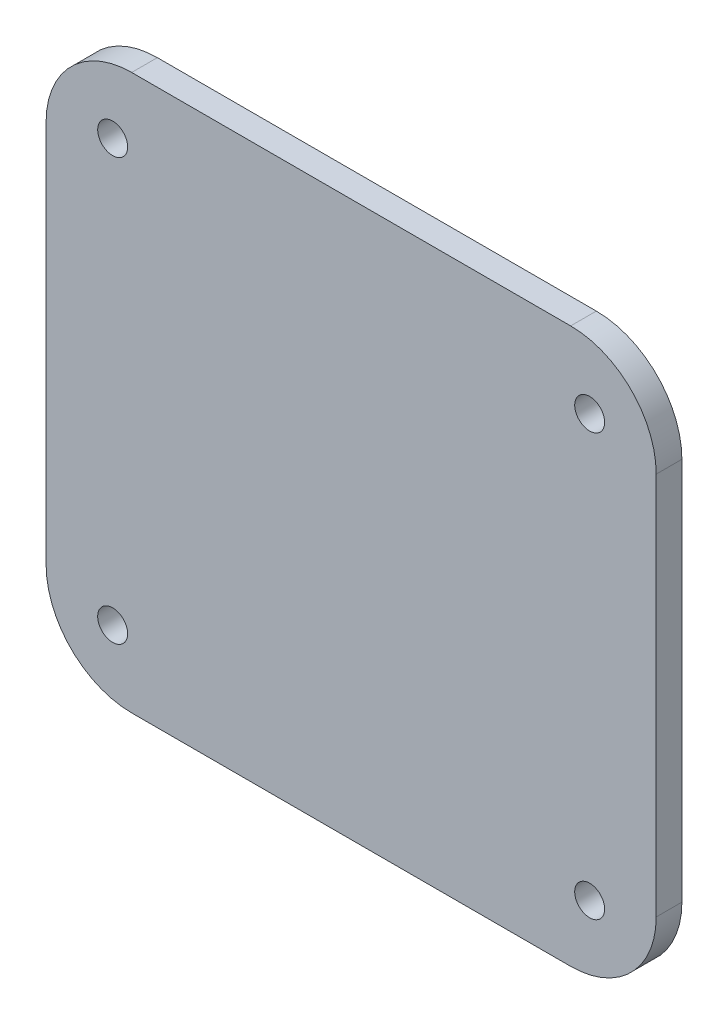
ISO-10303-21;
HEADER;
FILE_DESCRIPTION(('STEP AP214'),'2;1');
FILE_NAME('part.step','',(''),(''),'','','');
FILE_SCHEMA(('AUTOMOTIVE_DESIGN { 1 0 10303 214 1 1 1 1 }'));
ENDSEC;
DATA;
#1=APPLICATION_CONTEXT('core data for automotive mechanical design processes');
#2=APPLICATION_PROTOCOL_DEFINITION('international standard','automotive_design',2000,#1);
#3=PRODUCT_CONTEXT('',#1,'mechanical');
#4=PRODUCT('Part','Part','',(#3));
#5=PRODUCT_RELATED_PRODUCT_CATEGORY('part','',(#4));
#6=PRODUCT_DEFINITION_FORMATION('','',#4);
#7=PRODUCT_DEFINITION_CONTEXT('part definition',#1,'design');
#8=PRODUCT_DEFINITION('design','',#6,#7);
#9=PRODUCT_DEFINITION_SHAPE('','',#8);
#10=(LENGTH_UNIT() NAMED_UNIT(*) SI_UNIT(.MILLI.,.METRE.));
#11=(NAMED_UNIT(*) PLANE_ANGLE_UNIT() SI_UNIT($,.RADIAN.));
#12=(NAMED_UNIT(*) SI_UNIT($,.STERADIAN.) SOLID_ANGLE_UNIT());
#13=UNCERTAINTY_MEASURE_WITH_UNIT(LENGTH_MEASURE(1.E-05),#10,'distance_accuracy_value','');
#14=(GEOMETRIC_REPRESENTATION_CONTEXT(3) GLOBAL_UNCERTAINTY_ASSIGNED_CONTEXT((#13)) GLOBAL_UNIT_ASSIGNED_CONTEXT((#10,
#11,#12)) REPRESENTATION_CONTEXT('',''));
#15=CARTESIAN_POINT('',(0.,0.,0.));
#16=DIRECTION('',(0.,0.,1.));
#17=DIRECTION('',(1.,0.,0.));
#18=AXIS2_PLACEMENT_3D('',#15,#16,#17);
#19=CARTESIAN_POINT('',(0.,32.4252959785369,3.));
#20=DIRECTION('',(0.,-1.,0.));
#21=DIRECTION('',(0.,0.,-1.));
#22=AXIS2_PLACEMENT_3D('',#19,#20,#21);
#23=PLANE('',#22);
#24=DIRECTION('',(-1.,0.,0.));
#25=VECTOR('',#24,1.);
#26=CARTESIAN_POINT('',(0.,32.4252959785369,3.));
#27=LINE('',#26,#25);
#28=CARTESIAN_POINT('',(25.9780640714253,32.4252959785369,3.));
#29=VERTEX_POINT('',#28);
#30=CARTESIAN_POINT('',(-25.318232224871,32.4252959785369,3.));
#31=VERTEX_POINT('',#30);
#32=EDGE_CURVE('E185',#29,#31,#27,.T.);
#33=ORIENTED_EDGE('',*,*,#32,.F.);
#34=DIRECTION('',(0.,0.,-1.));
#35=VECTOR('',#34,1.);
#36=CARTESIAN_POINT('',(25.9780640714253,32.4252959785369,3.));
#37=LINE('',#36,#35);
#38=CARTESIAN_POINT('',(25.9780640714253,32.4252959785369,0.));
#39=VERTEX_POINT('',#38);
#40=EDGE_CURVE('E11',#29,#39,#37,.T.);
#41=ORIENTED_EDGE('',*,*,#40,.T.);
#42=DIRECTION('',(-1.,0.,0.));
#43=VECTOR('',#42,1.);
#44=CARTESIAN_POINT('',(0.,32.4252959785369,0.));
#45=LINE('',#44,#43);
#46=CARTESIAN_POINT('',(-25.318232224871,32.4252959785369,0.));
#47=VERTEX_POINT('',#46);
#48=EDGE_CURVE('E144',#39,#47,#45,.T.);
#49=ORIENTED_EDGE('',*,*,#48,.T.);
#50=DIRECTION('',(0.,0.,-1.));
#51=VECTOR('',#50,1.);
#52=CARTESIAN_POINT('',(-25.318232224871,32.4252959785369,3.));
#53=LINE('',#52,#51);
#54=EDGE_CURVE('E50',#47,#31,#53,.F.);
#55=ORIENTED_EDGE('',*,*,#54,.T.);
#56=EDGE_LOOP('',(#33,#41,#49,#55));
#57=FACE_BOUND('',#56,.T.);
#58=ADVANCED_FACE('F41',(#57),#23,.F.);
#59=CARTESIAN_POINT('',(-35.318232224871,0.,3.));
#60=DIRECTION('',(1.,0.,0.));
#61=DIRECTION('',(0.,0.,-1.));
#62=AXIS2_PLACEMENT_3D('',#59,#60,#61);
#63=PLANE('',#62);
#64=DIRECTION('',(0.,-1.,0.));
#65=VECTOR('',#64,1.);
#66=CARTESIAN_POINT('',(-35.318232224871,0.,0.));
#67=LINE('',#66,#65);
#68=CARTESIAN_POINT('',(-35.318232224871,22.4252959785369,0.));
#69=VERTEX_POINT('',#68);
#70=CARTESIAN_POINT('',(-35.318232224871,-22.389518836278,0.));
#71=VERTEX_POINT('',#70);
#72=EDGE_CURVE('E138',#69,#71,#67,.T.);
#73=ORIENTED_EDGE('',*,*,#72,.T.);
#74=DIRECTION('',(0.,0.,-1.));
#75=VECTOR('',#74,1.);
#76=CARTESIAN_POINT('',(-35.318232224871,-22.389518836278,3.));
#77=LINE('',#76,#75);
#78=CARTESIAN_POINT('',(-35.318232224871,-22.389518836278,3.));
#79=VERTEX_POINT('',#78);
#80=EDGE_CURVE('E114',#71,#79,#77,.F.);
#81=ORIENTED_EDGE('',*,*,#80,.T.);
#82=DIRECTION('',(0.,-1.,0.));
#83=VECTOR('',#82,1.);
#84=CARTESIAN_POINT('',(-35.318232224871,0.,3.));
#85=LINE('',#84,#83);
#86=CARTESIAN_POINT('',(-35.318232224871,22.4252959785369,3.));
#87=VERTEX_POINT('',#86);
#88=EDGE_CURVE('E195',#87,#79,#85,.T.);
#89=ORIENTED_EDGE('',*,*,#88,.F.);
#90=DIRECTION('',(0.,0.,-1.));
#91=VECTOR('',#90,1.);
#92=CARTESIAN_POINT('',(-35.318232224871,22.4252959785369,3.));
#93=LINE('',#92,#91);
#94=EDGE_CURVE('E120',#87,#69,#93,.T.);
#95=ORIENTED_EDGE('',*,*,#94,.T.);
#96=EDGE_LOOP('',(#73,#81,#89,#95));
#97=FACE_BOUND('',#96,.T.);
#98=ADVANCED_FACE('F200',(#97),#63,.F.);
#99=CARTESIAN_POINT('',(0.,-32.389518836278,3.));
#100=DIRECTION('',(0.,1.,0.));
#101=DIRECTION('',(0.,0.,1.));
#102=AXIS2_PLACEMENT_3D('',#99,#100,#101);
#103=PLANE('',#102);
#104=DIRECTION('',(1.,0.,0.));
#105=VECTOR('',#104,1.);
#106=CARTESIAN_POINT('',(0.,-32.389518836278,3.));
#107=LINE('',#106,#105);
#108=CARTESIAN_POINT('',(-25.318232224871,-32.389518836278,3.));
#109=VERTEX_POINT('',#108);
#110=CARTESIAN_POINT('',(25.9780640714253,-32.389518836278,3.));
#111=VERTEX_POINT('',#110);
#112=EDGE_CURVE('E129',#109,#111,#107,.T.);
#113=ORIENTED_EDGE('',*,*,#112,.F.);
#114=DIRECTION('',(0.,0.,-1.));
#115=VECTOR('',#114,1.);
#116=CARTESIAN_POINT('',(-25.318232224871,-32.389518836278,3.));
#117=LINE('',#116,#115);
#118=CARTESIAN_POINT('',(-25.318232224871,-32.389518836278,0.));
#119=VERTEX_POINT('',#118);
#120=EDGE_CURVE('E113',#109,#119,#117,.T.);
#121=ORIENTED_EDGE('',*,*,#120,.T.);
#122=DIRECTION('',(1.,0.,0.));
#123=VECTOR('',#122,1.);
#124=CARTESIAN_POINT('',(0.,-32.389518836278,0.));
#125=LINE('',#124,#123);
#126=CARTESIAN_POINT('',(25.9780640714253,-32.389518836278,0.));
#127=VERTEX_POINT('',#126);
#128=EDGE_CURVE('E127',#119,#127,#125,.T.);
#129=ORIENTED_EDGE('',*,*,#128,.T.);
#130=DIRECTION('',(0.,0.,-1.));
#131=VECTOR('',#130,1.);
#132=CARTESIAN_POINT('',(25.9780640714253,-32.389518836278,3.));
#133=LINE('',#132,#131);
#134=EDGE_CURVE('E132',#127,#111,#133,.F.);
#135=ORIENTED_EDGE('',*,*,#134,.T.);
#136=EDGE_LOOP('',(#113,#121,#129,#135));
#137=FACE_BOUND('',#136,.T.);
#138=ADVANCED_FACE('F126',(#137),#103,.F.);
#139=CARTESIAN_POINT('',(-27.5404544470933,24.6475182007591,3.));
#140=DIRECTION('',(0.,0.,-1.));
#141=DIRECTION('',(-1.,0.,0.));
#142=AXIS2_PLACEMENT_3D('',#139,#140,#141);
#143=CYLINDRICAL_SURFACE('',#142,1.75);
#144=CARTESIAN_POINT('',(-27.5404544470933,24.6475182007591,3.));
#145=DIRECTION('',(0.,0.,1.));
#146=DIRECTION('',(1.,0.,0.));
#147=AXIS2_PLACEMENT_3D('',#144,#145,#146);
#148=CIRCLE('',#147,1.75);
#149=CARTESIAN_POINT('',(-25.7904544470933,24.6475182007591,3.));
#150=VERTEX_POINT('',#149);
#151=EDGE_CURVE('E196',#150,#150,#148,.T.);
#152=ORIENTED_EDGE('',*,*,#151,.T.);
#153=EDGE_LOOP('',(#152));
#154=FACE_BOUND('',#153,.T.);
#155=CARTESIAN_POINT('',(-27.5404544470933,24.6475182007591,0.));
#156=DIRECTION('',(0.,0.,1.));
#157=DIRECTION('',(1.,0.,0.));
#158=AXIS2_PLACEMENT_3D('',#155,#156,#157);
#159=CIRCLE('',#158,1.75);
#160=CARTESIAN_POINT('',(-25.7904544470933,24.6475182007591,0.));
#161=VERTEX_POINT('',#160);
#162=EDGE_CURVE('E202',#161,#161,#159,.T.);
#163=ORIENTED_EDGE('',*,*,#162,.F.);
#164=EDGE_LOOP('',(#163));
#165=FACE_BOUND('',#164,.T.);
#166=ADVANCED_FACE('F253',(#154,#165),#143,.F.);
#167=CARTESIAN_POINT('',(28.2002862936475,24.6475182007591,3.));
#168=DIRECTION('',(0.,0.,-1.));
#169=DIRECTION('',(-1.,0.,0.));
#170=AXIS2_PLACEMENT_3D('',#167,#168,#169);
#171=CYLINDRICAL_SURFACE('',#170,1.75);
#172=CARTESIAN_POINT('',(28.2002862936475,24.6475182007591,3.));
#173=DIRECTION('',(0.,0.,1.));
#174=DIRECTION('',(1.,0.,0.));
#175=AXIS2_PLACEMENT_3D('',#172,#173,#174);
#176=CIRCLE('',#175,1.75);
#177=CARTESIAN_POINT('',(29.9502862936475,24.6475182007591,3.));
#178=VERTEX_POINT('',#177);
#179=EDGE_CURVE('E228',#178,#178,#176,.T.);
#180=ORIENTED_EDGE('',*,*,#179,.T.);
#181=EDGE_LOOP('',(#180));
#182=FACE_BOUND('',#181,.T.);
#183=CARTESIAN_POINT('',(28.2002862936475,24.6475182007591,0.));
#184=DIRECTION('',(0.,0.,1.));
#185=DIRECTION('',(1.,0.,0.));
#186=AXIS2_PLACEMENT_3D('',#183,#184,#185);
#187=CIRCLE('',#186,1.75);
#188=CARTESIAN_POINT('',(29.9502862936475,24.6475182007591,0.));
#189=VERTEX_POINT('',#188);
#190=EDGE_CURVE('E205',#189,#189,#187,.T.);
#191=ORIENTED_EDGE('',*,*,#190,.F.);
#192=EDGE_LOOP('',(#191));
#193=FACE_BOUND('',#192,.T.);
#194=ADVANCED_FACE('F256',(#182,#193),#171,.F.);
#195=CARTESIAN_POINT('',(28.200286293648,-24.6117410585002,3.));
#196=DIRECTION('',(0.,0.,-1.));
#197=DIRECTION('',(-1.,0.,0.));
#198=AXIS2_PLACEMENT_3D('',#195,#196,#197);
#199=CYLINDRICAL_SURFACE('',#198,1.75);
#200=CARTESIAN_POINT('',(28.200286293648,-24.6117410585002,3.));
#201=DIRECTION('',(0.,0.,1.));
#202=DIRECTION('',(1.,0.,0.));
#203=AXIS2_PLACEMENT_3D('',#200,#201,#202);
#204=CIRCLE('',#203,1.75);
#205=CARTESIAN_POINT('',(29.950286293648,-24.6117410585002,3.));
#206=VERTEX_POINT('',#205);
#207=EDGE_CURVE('E232',#206,#206,#204,.T.);
#208=ORIENTED_EDGE('',*,*,#207,.T.);
#209=EDGE_LOOP('',(#208));
#210=FACE_BOUND('',#209,.T.);
#211=CARTESIAN_POINT('',(28.200286293648,-24.6117410585002,0.));
#212=DIRECTION('',(0.,0.,1.));
#213=DIRECTION('',(1.,0.,0.));
#214=AXIS2_PLACEMENT_3D('',#211,#212,#213);
#215=CIRCLE('',#214,1.75);
#216=CARTESIAN_POINT('',(29.950286293648,-24.6117410585002,0.));
#217=VERTEX_POINT('',#216);
#218=EDGE_CURVE('E211',#217,#217,#215,.T.);
#219=ORIENTED_EDGE('',*,*,#218,.F.);
#220=EDGE_LOOP('',(#219));
#221=FACE_BOUND('',#220,.T.);
#222=ADVANCED_FACE('F280',(#210,#221),#199,.F.);
#223=CARTESIAN_POINT('',(-27.5404544470927,-24.6117410585002,3.));
#224=DIRECTION('',(0.,0.,-1.));
#225=DIRECTION('',(-1.,0.,0.));
#226=AXIS2_PLACEMENT_3D('',#223,#224,#225);
#227=CYLINDRICAL_SURFACE('',#226,1.75);
#228=CARTESIAN_POINT('',(-27.5404544470927,-24.6117410585002,3.));
#229=DIRECTION('',(0.,0.,1.));
#230=DIRECTION('',(1.,0.,0.));
#231=AXIS2_PLACEMENT_3D('',#228,#229,#230);
#232=CIRCLE('',#231,1.75);
#233=CARTESIAN_POINT('',(-25.7904544470927,-24.6117410585002,3.));
#234=VERTEX_POINT('',#233);
#235=EDGE_CURVE('E142',#234,#234,#232,.T.);
#236=ORIENTED_EDGE('',*,*,#235,.T.);
#237=EDGE_LOOP('',(#236));
#238=FACE_BOUND('',#237,.T.);
#239=CARTESIAN_POINT('',(-27.5404544470927,-24.6117410585002,0.));
#240=DIRECTION('',(0.,0.,1.));
#241=DIRECTION('',(1.,0.,0.));
#242=AXIS2_PLACEMENT_3D('',#239,#240,#241);
#243=CIRCLE('',#242,1.75);
#244=CARTESIAN_POINT('',(-25.7904544470927,-24.6117410585002,0.));
#245=VERTEX_POINT('',#244);
#246=EDGE_CURVE('E215',#245,#245,#243,.T.);
#247=ORIENTED_EDGE('',*,*,#246,.F.);
#248=EDGE_LOOP('',(#247));
#249=FACE_BOUND('',#248,.T.);
#250=ADVANCED_FACE('F240',(#238,#249),#227,.F.);
#251=CARTESIAN_POINT('',(35.9780640714253,0.,3.));
#252=DIRECTION('',(-1.,0.,0.));
#253=DIRECTION('',(0.,0.,1.));
#254=AXIS2_PLACEMENT_3D('',#251,#252,#253);
#255=PLANE('',#254);
#256=DIRECTION('',(0.,1.,0.));
#257=VECTOR('',#256,1.);
#258=CARTESIAN_POINT('',(35.9780640714253,0.,3.));
#259=LINE('',#258,#257);
#260=CARTESIAN_POINT('',(35.9780640714253,-22.389518836278,3.));
#261=VERTEX_POINT('',#260);
#262=CARTESIAN_POINT('',(35.9780640714253,22.4252959785369,3.));
#263=VERTEX_POINT('',#262);
#264=EDGE_CURVE('E149',#261,#263,#259,.T.);
#265=ORIENTED_EDGE('',*,*,#264,.F.);
#266=DIRECTION('',(0.,0.,-1.));
#267=VECTOR('',#266,1.);
#268=CARTESIAN_POINT('',(35.9780640714253,-22.389518836278,3.));
#269=LINE('',#268,#267);
#270=CARTESIAN_POINT('',(35.9780640714253,-22.389518836278,0.));
#271=VERTEX_POINT('',#270);
#272=EDGE_CURVE('E176',#261,#271,#269,.T.);
#273=ORIENTED_EDGE('',*,*,#272,.T.);
#274=DIRECTION('',(0.,1.,0.));
#275=VECTOR('',#274,1.);
#276=CARTESIAN_POINT('',(35.9780640714253,0.,0.));
#277=LINE('',#276,#275);
#278=CARTESIAN_POINT('',(35.9780640714253,22.4252959785369,0.));
#279=VERTEX_POINT('',#278);
#280=EDGE_CURVE('E137',#271,#279,#277,.T.);
#281=ORIENTED_EDGE('',*,*,#280,.T.);
#282=DIRECTION('',(0.,0.,-1.));
#283=VECTOR('',#282,1.);
#284=CARTESIAN_POINT('',(35.9780640714253,22.4252959785369,3.));
#285=LINE('',#284,#283);
#286=EDGE_CURVE('E57',#279,#263,#285,.F.);
#287=ORIENTED_EDGE('',*,*,#286,.T.);
#288=EDGE_LOOP('',(#265,#273,#281,#287));
#289=FACE_BOUND('',#288,.T.);
#290=ADVANCED_FACE('F245',(#289),#255,.F.);
#291=CARTESIAN_POINT('',(0.,0.,3.));
#292=DIRECTION('',(0.,0.,1.));
#293=DIRECTION('',(1.,0.,0.));
#294=AXIS2_PLACEMENT_3D('',#291,#292,#293);
#295=PLANE('',#294);
#296=ORIENTED_EDGE('',*,*,#235,.F.);
#297=EDGE_LOOP('',(#296));
#298=FACE_BOUND('',#297,.T.);
#299=ORIENTED_EDGE('',*,*,#207,.F.);
#300=EDGE_LOOP('',(#299));
#301=FACE_BOUND('',#300,.T.);
#302=ORIENTED_EDGE('',*,*,#179,.F.);
#303=EDGE_LOOP('',(#302));
#304=FACE_BOUND('',#303,.T.);
#305=ORIENTED_EDGE('',*,*,#151,.F.);
#306=EDGE_LOOP('',(#305));
#307=FACE_BOUND('',#306,.T.);
#308=ORIENTED_EDGE('',*,*,#88,.T.);
#309=CARTESIAN_POINT('',(-25.318232224871,-22.389518836278,3.));
#310=DIRECTION('',(0.,0.,1.));
#311=DIRECTION('',(1.,0.,0.));
#312=AXIS2_PLACEMENT_3D('',#309,#310,#311);
#313=CIRCLE('',#312,10.);
#314=EDGE_CURVE('E171',#79,#109,#313,.T.);
#315=ORIENTED_EDGE('',*,*,#314,.T.);
#316=ORIENTED_EDGE('',*,*,#112,.T.);
#317=CARTESIAN_POINT('',(25.9780640714253,-22.389518836278,3.));
#318=DIRECTION('',(0.,0.,1.));
#319=DIRECTION('',(1.,0.,0.));
#320=AXIS2_PLACEMENT_3D('',#317,#318,#319);
#321=CIRCLE('',#320,10.);
#322=EDGE_CURVE('E64',#111,#261,#321,.T.);
#323=ORIENTED_EDGE('',*,*,#322,.T.);
#324=ORIENTED_EDGE('',*,*,#264,.T.);
#325=CARTESIAN_POINT('',(25.9780640714253,22.4252959785369,3.));
#326=DIRECTION('',(0.,0.,1.));
#327=DIRECTION('',(1.,0.,0.));
#328=AXIS2_PLACEMENT_3D('',#325,#326,#327);
#329=CIRCLE('',#328,10.);
#330=EDGE_CURVE('E166',#263,#29,#329,.T.);
#331=ORIENTED_EDGE('',*,*,#330,.T.);
#332=ORIENTED_EDGE('',*,*,#32,.T.);
#333=CARTESIAN_POINT('',(-25.318232224871,22.4252959785369,3.));
#334=DIRECTION('',(0.,0.,1.));
#335=DIRECTION('',(1.,0.,0.));
#336=AXIS2_PLACEMENT_3D('',#333,#334,#335);
#337=CIRCLE('',#336,10.);
#338=EDGE_CURVE('E163',#31,#87,#337,.T.);
#339=ORIENTED_EDGE('',*,*,#338,.T.);
#340=EDGE_LOOP('',(#308,#315,#316,#323,#324,#331,#332,#339));
#341=FACE_BOUND('',#340,.T.);
#342=ADVANCED_FACE('F191',(#298,#301,#304,#307,#341),#295,.T.);
#343=CARTESIAN_POINT('',(0.,0.,0.));
#344=DIRECTION('',(0.,0.,1.));
#345=DIRECTION('',(1.,0.,0.));
#346=AXIS2_PLACEMENT_3D('',#343,#344,#345);
#347=PLANE('',#346);
#348=ORIENTED_EDGE('',*,*,#246,.T.);
#349=EDGE_LOOP('',(#348));
#350=FACE_BOUND('',#349,.T.);
#351=ORIENTED_EDGE('',*,*,#218,.T.);
#352=EDGE_LOOP('',(#351));
#353=FACE_BOUND('',#352,.T.);
#354=ORIENTED_EDGE('',*,*,#190,.T.);
#355=EDGE_LOOP('',(#354));
#356=FACE_BOUND('',#355,.T.);
#357=ORIENTED_EDGE('',*,*,#162,.T.);
#358=EDGE_LOOP('',(#357));
#359=FACE_BOUND('',#358,.T.);
#360=ORIENTED_EDGE('',*,*,#128,.F.);
#361=CARTESIAN_POINT('',(-25.318232224871,-22.389518836278,0.));
#362=DIRECTION('',(0.,0.,1.));
#363=DIRECTION('',(1.,0.,0.));
#364=AXIS2_PLACEMENT_3D('',#361,#362,#363);
#365=CIRCLE('',#364,10.);
#366=EDGE_CURVE('E109',#119,#71,#365,.F.);
#367=ORIENTED_EDGE('',*,*,#366,.T.);
#368=ORIENTED_EDGE('',*,*,#72,.F.);
#369=CARTESIAN_POINT('',(-25.318232224871,22.4252959785369,0.));
#370=DIRECTION('',(0.,0.,1.));
#371=DIRECTION('',(1.,0.,0.));
#372=AXIS2_PLACEMENT_3D('',#369,#370,#371);
#373=CIRCLE('',#372,10.);
#374=EDGE_CURVE('E131',#69,#47,#373,.F.);
#375=ORIENTED_EDGE('',*,*,#374,.T.);
#376=ORIENTED_EDGE('',*,*,#48,.F.);
#377=CARTESIAN_POINT('',(25.9780640714253,22.4252959785369,0.));
#378=DIRECTION('',(0.,0.,1.));
#379=DIRECTION('',(1.,0.,0.));
#380=AXIS2_PLACEMENT_3D('',#377,#378,#379);
#381=CIRCLE('',#380,10.);
#382=EDGE_CURVE('E153',#39,#279,#381,.F.);
#383=ORIENTED_EDGE('',*,*,#382,.T.);
#384=ORIENTED_EDGE('',*,*,#280,.F.);
#385=CARTESIAN_POINT('',(25.9780640714253,-22.389518836278,0.));
#386=DIRECTION('',(0.,0.,1.));
#387=DIRECTION('',(1.,0.,0.));
#388=AXIS2_PLACEMENT_3D('',#385,#386,#387);
#389=CIRCLE('',#388,10.);
#390=EDGE_CURVE('E121',#271,#127,#389,.F.);
#391=ORIENTED_EDGE('',*,*,#390,.T.);
#392=EDGE_LOOP('',(#360,#367,#368,#375,#376,#383,#384,#391));
#393=FACE_BOUND('',#392,.T.);
#394=ADVANCED_FACE('F134',(#350,#353,#356,#359,#393),#347,.F.);
#395=CARTESIAN_POINT('',(-25.318232224871,-22.389518836278,3.));
#396=DIRECTION('',(0.,0.,-1.));
#397=DIRECTION('',(-1.,0.,0.));
#398=AXIS2_PLACEMENT_3D('',#395,#396,#397);
#399=CYLINDRICAL_SURFACE('',#398,10.);
#400=ORIENTED_EDGE('',*,*,#314,.F.);
#401=ORIENTED_EDGE('',*,*,#80,.F.);
#402=ORIENTED_EDGE('',*,*,#366,.F.);
#403=ORIENTED_EDGE('',*,*,#120,.F.);
#404=EDGE_LOOP('',(#400,#401,#402,#403));
#405=FACE_BOUND('',#404,.T.);
#406=ADVANCED_FACE('F112',(#405),#399,.T.);
#407=CARTESIAN_POINT('',(25.9780640714253,-22.389518836278,3.));
#408=DIRECTION('',(0.,0.,-1.));
#409=DIRECTION('',(-1.,0.,0.));
#410=AXIS2_PLACEMENT_3D('',#407,#408,#409);
#411=CYLINDRICAL_SURFACE('',#410,10.);
#412=ORIENTED_EDGE('',*,*,#322,.F.);
#413=ORIENTED_EDGE('',*,*,#134,.F.);
#414=ORIENTED_EDGE('',*,*,#390,.F.);
#415=ORIENTED_EDGE('',*,*,#272,.F.);
#416=EDGE_LOOP('',(#412,#413,#414,#415));
#417=FACE_BOUND('',#416,.T.);
#418=ADVANCED_FACE('F266',(#417),#411,.T.);
#419=CARTESIAN_POINT('',(25.9780640714253,22.4252959785369,3.));
#420=DIRECTION('',(0.,0.,-1.));
#421=DIRECTION('',(-1.,0.,0.));
#422=AXIS2_PLACEMENT_3D('',#419,#420,#421);
#423=CYLINDRICAL_SURFACE('',#422,10.);
#424=ORIENTED_EDGE('',*,*,#330,.F.);
#425=ORIENTED_EDGE('',*,*,#286,.F.);
#426=ORIENTED_EDGE('',*,*,#382,.F.);
#427=ORIENTED_EDGE('',*,*,#40,.F.);
#428=EDGE_LOOP('',(#424,#425,#426,#427));
#429=FACE_BOUND('',#428,.T.);
#430=ADVANCED_FACE('F288',(#429),#423,.T.);
#431=CARTESIAN_POINT('',(-25.318232224871,22.4252959785369,3.));
#432=DIRECTION('',(0.,0.,-1.));
#433=DIRECTION('',(-1.,0.,0.));
#434=AXIS2_PLACEMENT_3D('',#431,#432,#433);
#435=CYLINDRICAL_SURFACE('',#434,10.);
#436=ORIENTED_EDGE('',*,*,#338,.F.);
#437=ORIENTED_EDGE('',*,*,#54,.F.);
#438=ORIENTED_EDGE('',*,*,#374,.F.);
#439=ORIENTED_EDGE('',*,*,#94,.F.);
#440=EDGE_LOOP('',(#436,#437,#438,#439));
#441=FACE_BOUND('',#440,.T.);
#442=ADVANCED_FACE('F43',(#441),#435,.T.);
#443=CLOSED_SHELL('',(#58,#98,#138,#166,#194,#222,#250,#290,#342,#394,#406,#418,#430,#442));
#444=MANIFOLD_SOLID_BREP('B2',#443);
#445=ADVANCED_BREP_SHAPE_REPRESENTATION('',(#18,#444),#14);
#446=SHAPE_DEFINITION_REPRESENTATION(#9,#445);
ENDSEC;
END-ISO-10303-21;
